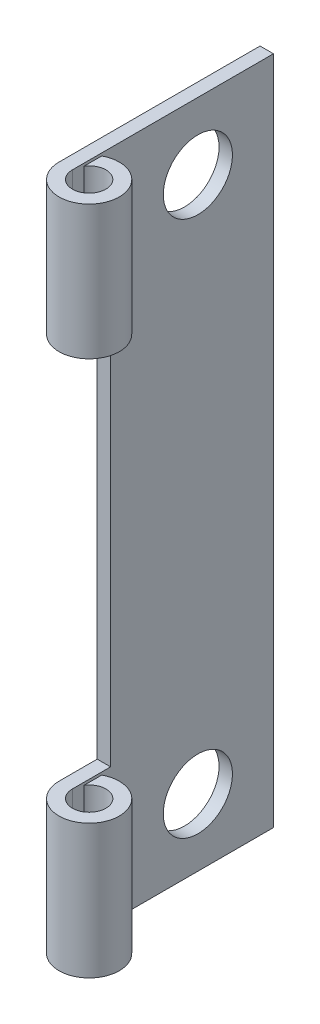
ISO-10303-21;
HEADER;
FILE_DESCRIPTION(('STEP AP214'),'2;1');
FILE_NAME('part.step','',(''),(''),'','','');
FILE_SCHEMA(('AUTOMOTIVE_DESIGN { 1 0 10303 214 1 1 1 1 }'));
ENDSEC;
DATA;
#1=APPLICATION_CONTEXT('core data for automotive mechanical design processes');
#2=APPLICATION_PROTOCOL_DEFINITION('international standard','automotive_design',2000,#1);
#3=PRODUCT_CONTEXT('',#1,'mechanical');
#4=PRODUCT('Part','Part','',(#3));
#5=PRODUCT_RELATED_PRODUCT_CATEGORY('part','',(#4));
#6=PRODUCT_DEFINITION_FORMATION('','',#4);
#7=PRODUCT_DEFINITION_CONTEXT('part definition',#1,'design');
#8=PRODUCT_DEFINITION('design','',#6,#7);
#9=PRODUCT_DEFINITION_SHAPE('','',#8);
#10=(LENGTH_UNIT() NAMED_UNIT(*) SI_UNIT(.MILLI.,.METRE.));
#11=(NAMED_UNIT(*) PLANE_ANGLE_UNIT() SI_UNIT($,.RADIAN.));
#12=(NAMED_UNIT(*) SI_UNIT($,.STERADIAN.) SOLID_ANGLE_UNIT());
#13=UNCERTAINTY_MEASURE_WITH_UNIT(LENGTH_MEASURE(1.E-05),#10,'distance_accuracy_value','');
#14=(GEOMETRIC_REPRESENTATION_CONTEXT(3) GLOBAL_UNCERTAINTY_ASSIGNED_CONTEXT((#13)) GLOBAL_UNIT_ASSIGNED_CONTEXT((#10,
#11,#12)) REPRESENTATION_CONTEXT('',''));
#15=CARTESIAN_POINT('',(0.,0.,0.));
#16=DIRECTION('',(0.,0.,1.));
#17=DIRECTION('',(1.,0.,0.));
#18=AXIS2_PLACEMENT_3D('',#15,#16,#17);
#19=CARTESIAN_POINT('',(0.635,31.75,-9.525));
#20=DIRECTION('',(-1.,0.,0.));
#21=DIRECTION('',(0.,0.,1.));
#22=AXIS2_PLACEMENT_3D('',#19,#20,#21);
#23=PLANE('',#22);
#24=CARTESIAN_POINT('',(0.635,28.575,-5.94359999999999));
#25=DIRECTION('',(-1.,0.,0.));
#26=DIRECTION('',(0.,0.,1.));
#27=AXIS2_PLACEMENT_3D('',#24,#25,#26);
#28=CIRCLE('',#27,1.6383);
#29=CARTESIAN_POINT('',(0.635,28.575,-4.30529999999999));
#30=VERTEX_POINT('',#29);
#31=EDGE_CURVE('E253',#30,#30,#28,.T.);
#32=ORIENTED_EDGE('',*,*,#31,.T.);
#33=EDGE_LOOP('',(#32));
#34=FACE_BOUND('',#33,.T.);
#35=CARTESIAN_POINT('',(0.635,3.175,-5.94359999999999));
#36=DIRECTION('',(-1.,0.,0.));
#37=DIRECTION('',(0.,0.,1.));
#38=AXIS2_PLACEMENT_3D('',#35,#36,#37);
#39=CIRCLE('',#38,1.6383);
#40=CARTESIAN_POINT('',(0.635,3.175,-4.30529999999999));
#41=VERTEX_POINT('',#40);
#42=EDGE_CURVE('E235',#41,#41,#39,.F.);
#43=ORIENTED_EDGE('',*,*,#42,.F.);
#44=EDGE_LOOP('',(#43));
#45=FACE_BOUND('',#44,.T.);
#46=DIRECTION('',(0.,0.,1.));
#47=VECTOR('',#46,1.);
#48=CARTESIAN_POINT('',(0.635,25.4,-9.525));
#49=LINE('',#48,#47);
#50=CARTESIAN_POINT('',(0.635,25.4,-1.80975));
#51=VERTEX_POINT('',#50);
#52=CARTESIAN_POINT('',(0.635,25.4,0.));
#53=VERTEX_POINT('',#52);
#54=EDGE_CURVE('E60',#51,#53,#49,.T.);
#55=ORIENTED_EDGE('',*,*,#54,.F.);
#56=DIRECTION('',(0.,1.,0.));
#57=VECTOR('',#56,1.);
#58=CARTESIAN_POINT('',(0.635,31.75,-1.80974999999999));
#59=LINE('',#58,#57);
#60=CARTESIAN_POINT('',(0.635,6.35,-1.80975));
#61=VERTEX_POINT('',#60);
#62=EDGE_CURVE('E152',#61,#51,#59,.T.);
#63=ORIENTED_EDGE('',*,*,#62,.F.);
#64=DIRECTION('',(0.,0.,-1.));
#65=VECTOR('',#64,1.);
#66=CARTESIAN_POINT('',(0.635,6.35,-9.52500000000001));
#67=LINE('',#66,#65);
#68=CARTESIAN_POINT('',(0.635,6.35,0.));
#69=VERTEX_POINT('',#68);
#70=EDGE_CURVE('E211',#69,#61,#67,.T.);
#71=ORIENTED_EDGE('',*,*,#70,.F.);
#72=DIRECTION('',(0.,-1.,0.));
#73=VECTOR('',#72,1.);
#74=CARTESIAN_POINT('',(0.635,31.75,0.));
#75=LINE('',#74,#73);
#76=CARTESIAN_POINT('',(0.635,0.,0.));
#77=VERTEX_POINT('',#76);
#78=EDGE_CURVE('E97',#69,#77,#75,.T.);
#79=ORIENTED_EDGE('',*,*,#78,.T.);
#80=DIRECTION('',(0.,0.,-1.));
#81=VECTOR('',#80,1.);
#82=CARTESIAN_POINT('',(0.635,0.,-9.525));
#83=LINE('',#82,#81);
#84=CARTESIAN_POINT('',(0.635,0.,-9.525));
#85=VERTEX_POINT('',#84);
#86=EDGE_CURVE('E148',#77,#85,#83,.T.);
#87=ORIENTED_EDGE('',*,*,#86,.T.);
#88=DIRECTION('',(0.,-1.,0.));
#89=VECTOR('',#88,1.);
#90=CARTESIAN_POINT('',(0.635,31.75,-9.525));
#91=LINE('',#90,#89);
#92=CARTESIAN_POINT('',(0.635,31.75,-9.525));
#93=VERTEX_POINT('',#92);
#94=EDGE_CURVE('E184',#93,#85,#91,.T.);
#95=ORIENTED_EDGE('',*,*,#94,.F.);
#96=DIRECTION('',(0.,0.,-1.));
#97=VECTOR('',#96,1.);
#98=CARTESIAN_POINT('',(0.635,31.75,-9.525));
#99=LINE('',#98,#97);
#100=CARTESIAN_POINT('',(0.635,31.75,0.));
#101=VERTEX_POINT('',#100);
#102=EDGE_CURVE('E103',#101,#93,#99,.T.);
#103=ORIENTED_EDGE('',*,*,#102,.F.);
#104=EDGE_CURVE('E170',#101,#53,#75,.T.);
#105=ORIENTED_EDGE('',*,*,#104,.T.);
#106=EDGE_LOOP('',(#55,#63,#71,#79,#87,#95,#103,#105));
#107=FACE_BOUND('',#106,.T.);
#108=ADVANCED_FACE('F45',(#34,#45,#107),#23,.F.);
#109=CARTESIAN_POINT('',(0.,31.75,-9.525));
#110=DIRECTION('',(1.,0.,0.));
#111=DIRECTION('',(0.,0.,-1.));
#112=AXIS2_PLACEMENT_3D('',#109,#110,#111);
#113=PLANE('',#112);
#114=CARTESIAN_POINT('',(0.,28.575,-5.94359999999999));
#115=DIRECTION('',(-1.,0.,0.));
#116=DIRECTION('',(0.,0.,-1.));
#117=AXIS2_PLACEMENT_3D('',#114,#115,#116);
#118=CIRCLE('',#117,1.6383);
#119=CARTESIAN_POINT('',(0.,28.575,-7.58189999999999));
#120=VERTEX_POINT('',#119);
#121=EDGE_CURVE('E257',#120,#120,#118,.T.);
#122=ORIENTED_EDGE('',*,*,#121,.F.);
#123=EDGE_LOOP('',(#122));
#124=FACE_BOUND('',#123,.T.);
#125=CARTESIAN_POINT('',(0.,3.175,-5.94359999999999));
#126=DIRECTION('',(1.,0.,0.));
#127=DIRECTION('',(0.,0.,-1.));
#128=AXIS2_PLACEMENT_3D('',#125,#126,#127);
#129=CIRCLE('',#128,1.6383);
#130=CARTESIAN_POINT('',(0.,3.175,-7.58189999999999));
#131=VERTEX_POINT('',#130);
#132=EDGE_CURVE('E249',#131,#131,#129,.T.);
#133=ORIENTED_EDGE('',*,*,#132,.T.);
#134=EDGE_LOOP('',(#133));
#135=FACE_BOUND('',#134,.T.);
#136=DIRECTION('',(0.,1.,0.));
#137=VECTOR('',#136,1.);
#138=CARTESIAN_POINT('',(0.,12.7,-1.80975));
#139=LINE('',#138,#137);
#140=CARTESIAN_POINT('',(0.,6.35,-1.80975));
#141=VERTEX_POINT('',#140);
#142=CARTESIAN_POINT('',(0.,25.4,-1.80975));
#143=VERTEX_POINT('',#142);
#144=EDGE_CURVE('E239',#141,#143,#139,.T.);
#145=ORIENTED_EDGE('',*,*,#144,.T.);
#146=DIRECTION('',(0.,0.,1.));
#147=VECTOR('',#146,1.);
#148=CARTESIAN_POINT('',(0.,25.4,1.80975));
#149=LINE('',#148,#147);
#150=CARTESIAN_POINT('',(0.,25.4,0.));
#151=VERTEX_POINT('',#150);
#152=EDGE_CURVE('E231',#143,#151,#149,.T.);
#153=ORIENTED_EDGE('',*,*,#152,.T.);
#154=DIRECTION('',(0.,-1.,0.));
#155=VECTOR('',#154,1.);
#156=CARTESIAN_POINT('',(0.,31.75,0.));
#157=LINE('',#156,#155);
#158=CARTESIAN_POINT('',(0.,31.75,0.));
#159=VERTEX_POINT('',#158);
#160=EDGE_CURVE('E177',#159,#151,#157,.T.);
#161=ORIENTED_EDGE('',*,*,#160,.F.);
#162=DIRECTION('',(0.,0.,1.));
#163=VECTOR('',#162,1.);
#164=CARTESIAN_POINT('',(0.,31.75,-9.525));
#165=LINE('',#164,#163);
#166=CARTESIAN_POINT('',(0.,31.75,-9.525));
#167=VERTEX_POINT('',#166);
#168=EDGE_CURVE('E120',#167,#159,#165,.T.);
#169=ORIENTED_EDGE('',*,*,#168,.F.);
#170=DIRECTION('',(0.,-1.,0.));
#171=VECTOR('',#170,1.);
#172=CARTESIAN_POINT('',(0.,31.75,-9.525));
#173=LINE('',#172,#171);
#174=CARTESIAN_POINT('',(0.,0.,-9.525));
#175=VERTEX_POINT('',#174);
#176=EDGE_CURVE('E180',#167,#175,#173,.T.);
#177=ORIENTED_EDGE('',*,*,#176,.T.);
#178=DIRECTION('',(0.,0.,1.));
#179=VECTOR('',#178,1.);
#180=CARTESIAN_POINT('',(0.,0.,-9.525));
#181=LINE('',#180,#179);
#182=CARTESIAN_POINT('',(0.,0.,0.));
#183=VERTEX_POINT('',#182);
#184=EDGE_CURVE('E155',#175,#183,#181,.T.);
#185=ORIENTED_EDGE('',*,*,#184,.T.);
#186=CARTESIAN_POINT('',(0.,6.35,0.));
#187=VERTEX_POINT('',#186);
#188=EDGE_CURVE('E136',#187,#183,#157,.T.);
#189=ORIENTED_EDGE('',*,*,#188,.F.);
#190=DIRECTION('',(0.,0.,-1.));
#191=VECTOR('',#190,1.);
#192=CARTESIAN_POINT('',(0.,6.35,1.80975));
#193=LINE('',#192,#191);
#194=EDGE_CURVE('E230',#187,#141,#193,.T.);
#195=ORIENTED_EDGE('',*,*,#194,.T.);
#196=EDGE_LOOP('',(#145,#153,#161,#169,#177,#185,#189,#195));
#197=FACE_BOUND('',#196,.T.);
#198=ADVANCED_FACE('F265',(#124,#135,#197),#113,.F.);
#199=CARTESIAN_POINT('',(1.42875,31.75,0.));
#200=DIRECTION('',(0.,-1.,0.));
#201=DIRECTION('',(0.,0.,-1.));
#202=AXIS2_PLACEMENT_3D('',#199,#200,#201);
#203=CYLINDRICAL_SURFACE('',#202,1.42875);
#204=DIRECTION('',(0.,-1.,0.));
#205=VECTOR('',#204,1.);
#206=CARTESIAN_POINT('',(0.762000000000002,31.75,-1.26363404512541));
#207=LINE('',#206,#205);
#208=CARTESIAN_POINT('',(0.762000000000001,6.35,-1.26363404512541));
#209=VERTEX_POINT('',#208);
#210=CARTESIAN_POINT('',(0.762000000000002,0.,-1.26363404512541));
#211=VERTEX_POINT('',#210);
#212=EDGE_CURVE('E137',#209,#211,#207,.T.);
#213=ORIENTED_EDGE('',*,*,#212,.F.);
#214=CARTESIAN_POINT('',(1.42875,6.35,0.));
#215=DIRECTION('',(0.,1.,0.));
#216=DIRECTION('',(0.,0.,1.));
#217=AXIS2_PLACEMENT_3D('',#214,#215,#216);
#218=CIRCLE('',#217,1.42875);
#219=EDGE_CURVE('E210',#187,#209,#218,.T.);
#220=ORIENTED_EDGE('',*,*,#219,.F.);
#221=ORIENTED_EDGE('',*,*,#188,.T.);
#222=CARTESIAN_POINT('',(1.42875,0.,0.));
#223=DIRECTION('',(0.,1.,0.));
#224=DIRECTION('',(0.,0.,1.));
#225=AXIS2_PLACEMENT_3D('',#222,#223,#224);
#226=CIRCLE('',#225,1.42875);
#227=EDGE_CURVE('E159',#183,#211,#226,.T.);
#228=ORIENTED_EDGE('',*,*,#227,.T.);
#229=EDGE_LOOP('',(#213,#220,#221,#228));
#230=FACE_BOUND('',#229,.T.);
#231=ADVANCED_FACE('F268',(#230),#203,.T.);
#232=ORIENTED_EDGE('',*,*,#160,.T.);
#233=CARTESIAN_POINT('',(1.42875,25.4,0.));
#234=DIRECTION('',(0.,-1.,0.));
#235=DIRECTION('',(0.,0.,-1.));
#236=AXIS2_PLACEMENT_3D('',#233,#234,#235);
#237=CIRCLE('',#236,1.42875);
#238=CARTESIAN_POINT('',(0.762000000000001,25.4,-1.26363404512541));
#239=VERTEX_POINT('',#238);
#240=EDGE_CURVE('E132',#239,#151,#237,.T.);
#241=ORIENTED_EDGE('',*,*,#240,.F.);
#242=CARTESIAN_POINT('',(0.762000000000002,31.75,-1.26363404512541));
#243=VERTEX_POINT('',#242);
#244=EDGE_CURVE('E128',#243,#239,#207,.T.);
#245=ORIENTED_EDGE('',*,*,#244,.F.);
#246=CARTESIAN_POINT('',(1.42875,31.75,0.));
#247=DIRECTION('',(0.,1.,0.));
#248=DIRECTION('',(0.,0.,1.));
#249=AXIS2_PLACEMENT_3D('',#246,#247,#248);
#250=CIRCLE('',#249,1.42875);
#251=EDGE_CURVE('E113',#159,#243,#250,.T.);
#252=ORIENTED_EDGE('',*,*,#251,.F.);
#253=EDGE_LOOP('',(#232,#241,#245,#252));
#254=FACE_BOUND('',#253,.T.);
#255=ADVANCED_FACE('F129',(#254),#203,.T.);
#256=CARTESIAN_POINT('',(0.762000000000001,31.75,-1.26363404512541));
#257=DIRECTION('',(1.,0.,0.));
#258=DIRECTION('',(0.,0.,-1.));
#259=AXIS2_PLACEMENT_3D('',#256,#257,#258);
#260=PLANE('',#259);
#261=DIRECTION('',(0.,0.,1.));
#262=VECTOR('',#261,1.);
#263=CARTESIAN_POINT('',(0.762000000000001,6.35,-1.26363404512541));
#264=LINE('',#263,#262);
#265=CARTESIAN_POINT('',(0.762000000000001,6.35,-0.430677953928457));
#266=VERTEX_POINT('',#265);
#267=EDGE_CURVE('E215',#209,#266,#264,.T.);
#268=ORIENTED_EDGE('',*,*,#267,.F.);
#269=ORIENTED_EDGE('',*,*,#212,.T.);
#270=DIRECTION('',(0.,0.,1.));
#271=VECTOR('',#270,1.);
#272=CARTESIAN_POINT('',(0.762000000000001,0.,-1.26363404512541));
#273=LINE('',#272,#271);
#274=CARTESIAN_POINT('',(0.762000000000001,0.,-0.430677953928457));
#275=VERTEX_POINT('',#274);
#276=EDGE_CURVE('E163',#211,#275,#273,.T.);
#277=ORIENTED_EDGE('',*,*,#276,.T.);
#278=DIRECTION('',(0.,-1.,0.));
#279=VECTOR('',#278,1.);
#280=CARTESIAN_POINT('',(0.762000000000001,31.75,-0.430677953928457));
#281=LINE('',#280,#279);
#282=EDGE_CURVE('E174',#266,#275,#281,.T.);
#283=ORIENTED_EDGE('',*,*,#282,.F.);
#284=EDGE_LOOP('',(#268,#269,#277,#283));
#285=FACE_BOUND('',#284,.T.);
#286=ADVANCED_FACE('F304',(#285),#260,.F.);
#287=DIRECTION('',(0.,0.,-1.));
#288=VECTOR('',#287,1.);
#289=CARTESIAN_POINT('',(0.762000000000001,25.4,-1.26363404512541));
#290=LINE('',#289,#288);
#291=CARTESIAN_POINT('',(0.762000000000001,25.4,-0.430677953928457));
#292=VERTEX_POINT('',#291);
#293=EDGE_CURVE('E191',#292,#239,#290,.T.);
#294=ORIENTED_EDGE('',*,*,#293,.F.);
#295=CARTESIAN_POINT('',(0.762000000000001,31.75,-0.430677953928457));
#296=VERTEX_POINT('',#295);
#297=EDGE_CURVE('E141',#296,#292,#281,.T.);
#298=ORIENTED_EDGE('',*,*,#297,.F.);
#299=DIRECTION('',(0.,0.,1.));
#300=VECTOR('',#299,1.);
#301=CARTESIAN_POINT('',(0.762000000000001,31.75,-1.26363404512541));
#302=LINE('',#301,#300);
#303=EDGE_CURVE('E117',#243,#296,#302,.T.);
#304=ORIENTED_EDGE('',*,*,#303,.F.);
#305=ORIENTED_EDGE('',*,*,#244,.T.);
#306=EDGE_LOOP('',(#294,#298,#304,#305));
#307=FACE_BOUND('',#306,.T.);
#308=ADVANCED_FACE('F139',(#307),#260,.F.);
#309=CARTESIAN_POINT('',(1.42875,31.75,0.));
#310=DIRECTION('',(0.,-1.,0.));
#311=DIRECTION('',(0.,0.,-1.));
#312=AXIS2_PLACEMENT_3D('',#309,#310,#311);
#313=CYLINDRICAL_SURFACE('',#312,0.79375);
#314=CARTESIAN_POINT('',(1.42875,6.35,0.));
#315=DIRECTION('',(0.,1.,0.));
#316=DIRECTION('',(0.,0.,1.));
#317=AXIS2_PLACEMENT_3D('',#314,#315,#316);
#318=CIRCLE('',#317,0.79375);
#319=EDGE_CURVE('E11',#266,#69,#318,.F.);
#320=ORIENTED_EDGE('',*,*,#319,.F.);
#321=ORIENTED_EDGE('',*,*,#282,.T.);
#322=CARTESIAN_POINT('',(1.42875,0.,0.));
#323=DIRECTION('',(0.,-1.,0.));
#324=DIRECTION('',(0.,0.,1.));
#325=AXIS2_PLACEMENT_3D('',#322,#323,#324);
#326=CIRCLE('',#325,0.79375);
#327=EDGE_CURVE('E167',#275,#77,#326,.T.);
#328=ORIENTED_EDGE('',*,*,#327,.T.);
#329=ORIENTED_EDGE('',*,*,#78,.F.);
#330=EDGE_LOOP('',(#320,#321,#328,#329));
#331=FACE_BOUND('',#330,.T.);
#332=ADVANCED_FACE('F312',(#331),#313,.F.);
#333=CARTESIAN_POINT('',(1.42875,25.4,0.));
#334=DIRECTION('',(0.,-1.,0.));
#335=DIRECTION('',(0.,0.,-1.));
#336=AXIS2_PLACEMENT_3D('',#333,#334,#335);
#337=CIRCLE('',#336,0.79375);
#338=EDGE_CURVE('E53',#53,#292,#337,.F.);
#339=ORIENTED_EDGE('',*,*,#338,.F.);
#340=ORIENTED_EDGE('',*,*,#104,.F.);
#341=CARTESIAN_POINT('',(1.42875,31.75,0.));
#342=DIRECTION('',(0.,-1.,0.));
#343=DIRECTION('',(0.,0.,1.));
#344=AXIS2_PLACEMENT_3D('',#341,#342,#343);
#345=CIRCLE('',#344,0.79375);
#346=EDGE_CURVE('E69',#296,#101,#345,.T.);
#347=ORIENTED_EDGE('',*,*,#346,.F.);
#348=ORIENTED_EDGE('',*,*,#297,.T.);
#349=EDGE_LOOP('',(#339,#340,#347,#348));
#350=FACE_BOUND('',#349,.T.);
#351=ADVANCED_FACE('F198',(#350),#313,.F.);
#352=CARTESIAN_POINT('',(0.635,31.75,-9.525));
#353=DIRECTION('',(0.,0.,1.));
#354=DIRECTION('',(1.,0.,0.));
#355=AXIS2_PLACEMENT_3D('',#352,#353,#354);
#356=PLANE('',#355);
#357=DIRECTION('',(-1.,0.,0.));
#358=VECTOR('',#357,1.);
#359=CARTESIAN_POINT('',(0.635,0.,-9.525));
#360=LINE('',#359,#358);
#361=EDGE_CURVE('E151',#85,#175,#360,.T.);
#362=ORIENTED_EDGE('',*,*,#361,.T.);
#363=ORIENTED_EDGE('',*,*,#176,.F.);
#364=DIRECTION('',(-1.,0.,0.));
#365=VECTOR('',#364,1.);
#366=CARTESIAN_POINT('',(0.635,31.75,-9.525));
#367=LINE('',#366,#365);
#368=EDGE_CURVE('E201',#93,#167,#367,.T.);
#369=ORIENTED_EDGE('',*,*,#368,.F.);
#370=ORIENTED_EDGE('',*,*,#94,.T.);
#371=EDGE_LOOP('',(#362,#363,#369,#370));
#372=FACE_BOUND('',#371,.T.);
#373=ADVANCED_FACE('F320',(#372),#356,.F.);
#374=CARTESIAN_POINT('',(1.42875,31.75,0.));
#375=DIRECTION('',(0.,1.,0.));
#376=DIRECTION('',(0.,0.,1.));
#377=AXIS2_PLACEMENT_3D('',#374,#375,#376);
#378=PLANE('',#377);
#379=ORIENTED_EDGE('',*,*,#168,.T.);
#380=ORIENTED_EDGE('',*,*,#251,.T.);
#381=ORIENTED_EDGE('',*,*,#303,.T.);
#382=ORIENTED_EDGE('',*,*,#346,.T.);
#383=ORIENTED_EDGE('',*,*,#102,.T.);
#384=ORIENTED_EDGE('',*,*,#368,.T.);
#385=EDGE_LOOP('',(#379,#380,#381,#382,#383,#384));
#386=FACE_BOUND('',#385,.T.);
#387=ADVANCED_FACE('F115',(#386),#378,.T.);
#388=CARTESIAN_POINT('',(1.42875,0.,0.));
#389=DIRECTION('',(0.,1.,0.));
#390=DIRECTION('',(0.,0.,1.));
#391=AXIS2_PLACEMENT_3D('',#388,#389,#390);
#392=PLANE('',#391);
#393=ORIENTED_EDGE('',*,*,#86,.F.);
#394=ORIENTED_EDGE('',*,*,#327,.F.);
#395=ORIENTED_EDGE('',*,*,#276,.F.);
#396=ORIENTED_EDGE('',*,*,#227,.F.);
#397=ORIENTED_EDGE('',*,*,#184,.F.);
#398=ORIENTED_EDGE('',*,*,#361,.F.);
#399=EDGE_LOOP('',(#393,#394,#395,#396,#397,#398));
#400=FACE_BOUND('',#399,.T.);
#401=ADVANCED_FACE('F316',(#400),#392,.F.);
#402=CARTESIAN_POINT('',(2.8575,25.4,1.80975));
#403=DIRECTION('',(0.,-1.,0.));
#404=DIRECTION('',(0.,0.,-1.));
#405=AXIS2_PLACEMENT_3D('',#402,#403,#404);
#406=PLANE('',#405);
#407=ORIENTED_EDGE('',*,*,#54,.T.);
#408=ORIENTED_EDGE('',*,*,#338,.T.);
#409=ORIENTED_EDGE('',*,*,#293,.T.);
#410=ORIENTED_EDGE('',*,*,#240,.T.);
#411=ORIENTED_EDGE('',*,*,#152,.F.);
#412=DIRECTION('',(-1.,0.,0.));
#413=VECTOR('',#412,1.);
#414=CARTESIAN_POINT('',(2.8575,25.4,-1.80975));
#415=LINE('',#414,#413);
#416=EDGE_CURVE('E226',#51,#143,#415,.T.);
#417=ORIENTED_EDGE('',*,*,#416,.F.);
#418=EDGE_LOOP('',(#407,#408,#409,#410,#411,#417));
#419=FACE_BOUND('',#418,.T.);
#420=ADVANCED_FACE('F190',(#419),#406,.T.);
#421=CARTESIAN_POINT('',(2.8575,12.7,-1.80975));
#422=DIRECTION('',(0.,0.,1.));
#423=DIRECTION('',(0.,-1.,0.));
#424=AXIS2_PLACEMENT_3D('',#421,#422,#423);
#425=PLANE('',#424);
#426=ORIENTED_EDGE('',*,*,#62,.T.);
#427=ORIENTED_EDGE('',*,*,#416,.T.);
#428=ORIENTED_EDGE('',*,*,#144,.F.);
#429=DIRECTION('',(-1.,0.,0.));
#430=VECTOR('',#429,1.);
#431=CARTESIAN_POINT('',(2.8575,6.35,-1.80975));
#432=LINE('',#431,#430);
#433=EDGE_CURVE('E196',#61,#141,#432,.T.);
#434=ORIENTED_EDGE('',*,*,#433,.F.);
#435=EDGE_LOOP('',(#426,#427,#428,#434));
#436=FACE_BOUND('',#435,.T.);
#437=ADVANCED_FACE('F282',(#436),#425,.T.);
#438=CARTESIAN_POINT('',(2.8575,6.35,1.80975));
#439=DIRECTION('',(0.,1.,0.));
#440=DIRECTION('',(0.,0.,1.));
#441=AXIS2_PLACEMENT_3D('',#438,#439,#440);
#442=PLANE('',#441);
#443=ORIENTED_EDGE('',*,*,#219,.T.);
#444=ORIENTED_EDGE('',*,*,#267,.T.);
#445=ORIENTED_EDGE('',*,*,#319,.T.);
#446=ORIENTED_EDGE('',*,*,#70,.T.);
#447=ORIENTED_EDGE('',*,*,#433,.T.);
#448=ORIENTED_EDGE('',*,*,#194,.F.);
#449=EDGE_LOOP('',(#443,#444,#445,#446,#447,#448));
#450=FACE_BOUND('',#449,.T.);
#451=ADVANCED_FACE('F299',(#450),#442,.T.);
#452=CARTESIAN_POINT('',(2.8575,3.175,-5.94359999999999));
#453=DIRECTION('',(-1.,0.,0.));
#454=DIRECTION('',(0.,0.,1.));
#455=AXIS2_PLACEMENT_3D('',#452,#453,#454);
#456=CYLINDRICAL_SURFACE('',#455,1.6383);
#457=ORIENTED_EDGE('',*,*,#132,.F.);
#458=EDGE_LOOP('',(#457));
#459=FACE_BOUND('',#458,.T.);
#460=ORIENTED_EDGE('',*,*,#42,.T.);
#461=EDGE_LOOP('',(#460));
#462=FACE_BOUND('',#461,.T.);
#463=ADVANCED_FACE('F336',(#459,#462),#456,.F.);
#464=CARTESIAN_POINT('',(2.8575,28.575,-5.94359999999999));
#465=DIRECTION('',(-1.,0.,0.));
#466=DIRECTION('',(0.,0.,1.));
#467=AXIS2_PLACEMENT_3D('',#464,#465,#466);
#468=CYLINDRICAL_SURFACE('',#467,1.6383);
#469=ORIENTED_EDGE('',*,*,#121,.T.);
#470=EDGE_LOOP('',(#469));
#471=FACE_BOUND('',#470,.T.);
#472=ORIENTED_EDGE('',*,*,#31,.F.);
#473=EDGE_LOOP('',(#472));
#474=FACE_BOUND('',#473,.T.);
#475=ADVANCED_FACE('F262',(#471,#474),#468,.F.);
#476=CLOSED_SHELL('',(#108,#198,#231,#255,#286,#308,#332,#351,#373,#387,#401,#420,#437,#451,
#463,#475));
#477=MANIFOLD_SOLID_BREP('B2',#476);
#478=ADVANCED_BREP_SHAPE_REPRESENTATION('',(#18,#477),#14);
#479=SHAPE_DEFINITION_REPRESENTATION(#9,#478);
ENDSEC;
END-ISO-10303-21;
